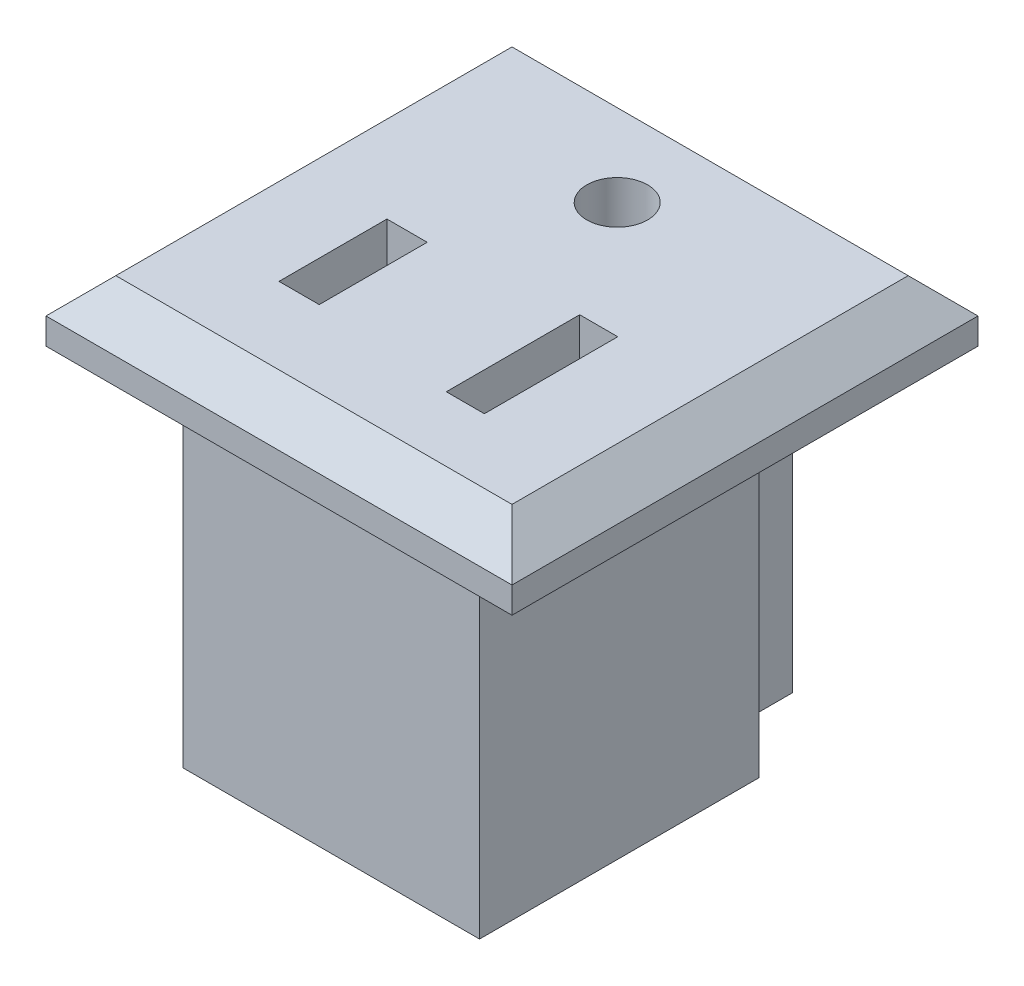
ISO-10303-21;
HEADER;
FILE_DESCRIPTION(('STEP AP214'),'2;1');
FILE_NAME('part.step','',(''),(''),'','','');
FILE_SCHEMA(('AUTOMOTIVE_DESIGN { 1 0 10303 214 1 1 1 1 }'));
ENDSEC;
DATA;
#1=APPLICATION_CONTEXT('core data for automotive mechanical design processes');
#2=APPLICATION_PROTOCOL_DEFINITION('international standard','automotive_design',2000,#1);
#3=PRODUCT_CONTEXT('',#1,'mechanical');
#4=PRODUCT('Part','Part','',(#3));
#5=PRODUCT_RELATED_PRODUCT_CATEGORY('part','',(#4));
#6=PRODUCT_DEFINITION_FORMATION('','',#4);
#7=PRODUCT_DEFINITION_CONTEXT('part definition',#1,'design');
#8=PRODUCT_DEFINITION('design','',#6,#7);
#9=PRODUCT_DEFINITION_SHAPE('','',#8);
#10=(LENGTH_UNIT() NAMED_UNIT(*) SI_UNIT(.MILLI.,.METRE.));
#11=(NAMED_UNIT(*) PLANE_ANGLE_UNIT() SI_UNIT($,.RADIAN.));
#12=(NAMED_UNIT(*) SI_UNIT($,.STERADIAN.) SOLID_ANGLE_UNIT());
#13=UNCERTAINTY_MEASURE_WITH_UNIT(LENGTH_MEASURE(1.E-05),#10,'distance_accuracy_value','');
#14=(GEOMETRIC_REPRESENTATION_CONTEXT(3) GLOBAL_UNCERTAINTY_ASSIGNED_CONTEXT((#13)) GLOBAL_UNIT_ASSIGNED_CONTEXT((#10,
#11,#12)) REPRESENTATION_CONTEXT('',''));
#15=CARTESIAN_POINT('',(0.,0.,0.));
#16=DIRECTION('',(0.,0.,1.));
#17=DIRECTION('',(1.,0.,0.));
#18=AXIS2_PLACEMENT_3D('',#15,#16,#17);
#19=CARTESIAN_POINT('',(0.,0.,0.));
#20=DIRECTION('',(0.,-1.,0.));
#21=DIRECTION('',(0.,0.,-1.));
#22=AXIS2_PLACEMENT_3D('',#19,#20,#21);
#23=PLANE('',#22);
#24=DIRECTION('',(0.,0.,1.));
#25=VECTOR('',#24,1.);
#26=CARTESIAN_POINT('',(-17.6814769975787,0.,0.));
#27=LINE('',#26,#25);
#28=CARTESIAN_POINT('',(-17.6814769975787,0.,-26.7));
#29=VERTEX_POINT('',#28);
#30=CARTESIAN_POINT('',(-17.6814769975787,0.,0.));
#31=VERTEX_POINT('',#30);
#32=EDGE_CURVE('E323',#29,#31,#27,.T.);
#33=ORIENTED_EDGE('',*,*,#32,.F.);
#34=DIRECTION('',(-1.,0.,0.));
#35=VECTOR('',#34,1.);
#36=CARTESIAN_POINT('',(-17.6814769975787,0.,-26.7));
#37=LINE('',#36,#35);
#38=CARTESIAN_POINT('',(9.01852300242131,0.,-26.7));
#39=VERTEX_POINT('',#38);
#40=EDGE_CURVE('E332',#39,#29,#37,.T.);
#41=ORIENTED_EDGE('',*,*,#40,.F.);
#42=DIRECTION('',(0.,0.,-1.));
#43=VECTOR('',#42,1.);
#44=CARTESIAN_POINT('',(9.01852300242131,0.,0.));
#45=LINE('',#44,#43);
#46=CARTESIAN_POINT('',(9.01852300242131,0.,0.));
#47=VERTEX_POINT('',#46);
#48=EDGE_CURVE('E329',#47,#39,#45,.T.);
#49=ORIENTED_EDGE('',*,*,#48,.F.);
#50=DIRECTION('',(1.,0.,0.));
#51=VECTOR('',#50,1.);
#52=CARTESIAN_POINT('',(-17.6814769975787,0.,0.));
#53=LINE('',#52,#51);
#54=EDGE_CURVE('E326',#31,#47,#53,.T.);
#55=ORIENTED_EDGE('',*,*,#54,.F.);
#56=EDGE_LOOP('',(#33,#41,#49,#55));
#57=FACE_BOUND('',#56,.T.);
#58=DIRECTION('',(1.,0.,0.));
#59=VECTOR('',#58,1.);
#60=CARTESIAN_POINT('',(-8.99745821000411,0.,-24.2));
#61=LINE('',#60,#59);
#62=CARTESIAN_POINT('',(-8.99745821000411,0.,-24.2));
#63=VERTEX_POINT('',#62);
#64=CARTESIAN_POINT('',(0.901796763469895,0.,-24.2));
#65=VERTEX_POINT('',#64);
#66=EDGE_CURVE('E274',#63,#65,#61,.T.);
#67=ORIENTED_EDGE('',*,*,#66,.F.);
#68=DIRECTION('',(0.,0.,-1.));
#69=VECTOR('',#68,1.);
#70=CARTESIAN_POINT('',(-8.99745821000411,0.,-19.));
#71=LINE('',#70,#69);
#72=CARTESIAN_POINT('',(-8.99745821000411,0.,-19.));
#73=VERTEX_POINT('',#72);
#74=EDGE_CURVE('E223',#73,#63,#71,.T.);
#75=ORIENTED_EDGE('',*,*,#74,.F.);
#76=DIRECTION('',(1.,0.,0.));
#77=VECTOR('',#76,1.);
#78=CARTESIAN_POINT('',(-12.8414769975787,0.,-19.));
#79=LINE('',#78,#77);
#80=CARTESIAN_POINT('',(-12.8414769975787,0.,-19.));
#81=VERTEX_POINT('',#80);
#82=EDGE_CURVE('E303',#81,#73,#79,.T.);
#83=ORIENTED_EDGE('',*,*,#82,.F.);
#84=DIRECTION('',(0.,0.,-1.));
#85=VECTOR('',#84,1.);
#86=CARTESIAN_POINT('',(-12.8414769975787,0.,-3.));
#87=LINE('',#86,#85);
#88=CARTESIAN_POINT('',(-12.8414769975787,0.,-3.));
#89=VERTEX_POINT('',#88);
#90=EDGE_CURVE('E286',#89,#81,#87,.T.);
#91=ORIENTED_EDGE('',*,*,#90,.F.);
#92=DIRECTION('',(-1.,0.,0.));
#93=VECTOR('',#92,1.);
#94=CARTESIAN_POINT('',(-12.8414769975787,0.,-3.));
#95=LINE('',#94,#93);
#96=CARTESIAN_POINT('',(4.15852300242131,0.,-3.));
#97=VERTEX_POINT('',#96);
#98=EDGE_CURVE('E291',#97,#89,#95,.T.);
#99=ORIENTED_EDGE('',*,*,#98,.F.);
#100=DIRECTION('',(0.,0.,1.));
#101=VECTOR('',#100,1.);
#102=CARTESIAN_POINT('',(4.15852300242131,0.,-3.));
#103=LINE('',#102,#101);
#104=CARTESIAN_POINT('',(4.15852300242131,0.,-19.));
#105=VERTEX_POINT('',#104);
#106=EDGE_CURVE('E306',#105,#97,#103,.T.);
#107=ORIENTED_EDGE('',*,*,#106,.F.);
#108=CARTESIAN_POINT('',(0.901796763469895,0.,-19.));
#109=VERTEX_POINT('',#108);
#110=EDGE_CURVE('E302',#109,#105,#79,.T.);
#111=ORIENTED_EDGE('',*,*,#110,.F.);
#112=DIRECTION('',(0.,0.,1.));
#113=VECTOR('',#112,1.);
#114=CARTESIAN_POINT('',(0.901796763469895,0.,-19.));
#115=LINE('',#114,#113);
#116=EDGE_CURVE('E266',#65,#109,#115,.T.);
#117=ORIENTED_EDGE('',*,*,#116,.F.);
#118=EDGE_LOOP('',(#67,#75,#83,#91,#99,#107,#111,#117));
#119=FACE_BOUND('',#118,.T.);
#120=ADVANCED_FACE('F37',(#57,#119),#23,.T.);
#121=CARTESIAN_POINT('',(-12.8414769975787,-20.,-19.));
#122=DIRECTION('',(0.,0.,1.));
#123=DIRECTION('',(1.,0.,0.));
#124=AXIS2_PLACEMENT_3D('',#121,#122,#123);
#125=PLANE('',#124);
#126=DIRECTION('',(0.,1.,0.));
#127=VECTOR('',#126,1.);
#128=CARTESIAN_POINT('',(-8.99745821000411,-20.,-19.));
#129=LINE('',#128,#127);
#130=CARTESIAN_POINT('',(-8.99745821000411,-20.,-19.));
#131=VERTEX_POINT('',#130);
#132=EDGE_CURVE('E271',#131,#73,#129,.T.);
#133=ORIENTED_EDGE('',*,*,#132,.F.);
#134=DIRECTION('',(1.,0.,0.));
#135=VECTOR('',#134,1.);
#136=CARTESIAN_POINT('',(-12.8414769975787,-20.,-19.));
#137=LINE('',#136,#135);
#138=CARTESIAN_POINT('',(-12.8414769975787,-20.,-19.));
#139=VERTEX_POINT('',#138);
#140=EDGE_CURVE('E292',#139,#131,#137,.T.);
#141=ORIENTED_EDGE('',*,*,#140,.F.);
#142=DIRECTION('',(0.,1.,0.));
#143=VECTOR('',#142,1.);
#144=CARTESIAN_POINT('',(-12.8414769975787,-20.,-19.));
#145=LINE('',#144,#143);
#146=EDGE_CURVE('E319',#139,#81,#145,.T.);
#147=ORIENTED_EDGE('',*,*,#146,.T.);
#148=ORIENTED_EDGE('',*,*,#82,.T.);
#149=EDGE_LOOP('',(#133,#141,#147,#148));
#150=FACE_BOUND('',#149,.T.);
#151=ADVANCED_FACE('F414',(#150),#125,.F.);
#152=DIRECTION('',(0.,1.,0.));
#153=VECTOR('',#152,1.);
#154=CARTESIAN_POINT('',(0.901796763469895,-20.,-19.));
#155=LINE('',#154,#153);
#156=CARTESIAN_POINT('',(0.901796763469895,-20.,-19.));
#157=VERTEX_POINT('',#156);
#158=EDGE_CURVE('E278',#157,#109,#155,.T.);
#159=ORIENTED_EDGE('',*,*,#158,.T.);
#160=ORIENTED_EDGE('',*,*,#110,.T.);
#161=DIRECTION('',(0.,1.,0.));
#162=VECTOR('',#161,1.);
#163=CARTESIAN_POINT('',(4.15852300242131,-20.,-19.));
#164=LINE('',#163,#162);
#165=CARTESIAN_POINT('',(4.15852300242131,-20.,-19.));
#166=VERTEX_POINT('',#165);
#167=EDGE_CURVE('E316',#166,#105,#164,.T.);
#168=ORIENTED_EDGE('',*,*,#167,.F.);
#169=EDGE_CURVE('E290',#157,#166,#137,.T.);
#170=ORIENTED_EDGE('',*,*,#169,.F.);
#171=EDGE_LOOP('',(#159,#160,#168,#170));
#172=FACE_BOUND('',#171,.T.);
#173=ADVANCED_FACE('F418',(#172),#125,.F.);
#174=CARTESIAN_POINT('',(-17.6814769975787,3.5,0.));
#175=DIRECTION('',(1.,0.,0.));
#176=DIRECTION('',(0.,0.,-1.));
#177=AXIS2_PLACEMENT_3D('',#174,#175,#176);
#178=PLANE('',#177);
#179=DIRECTION('',(0.,-1.,0.));
#180=VECTOR('',#179,1.);
#181=CARTESIAN_POINT('',(-17.6814769975787,3.5,0.));
#182=LINE('',#181,#180);
#183=CARTESIAN_POINT('',(-17.6814769975787,1.5,0.));
#184=VERTEX_POINT('',#183);
#185=EDGE_CURVE('E341',#184,#31,#182,.T.);
#186=ORIENTED_EDGE('',*,*,#185,.F.);
#187=DIRECTION('',(0.,0.,-1.));
#188=VECTOR('',#187,1.);
#189=CARTESIAN_POINT('',(-17.6814769975787,1.5,0.));
#190=LINE('',#189,#188);
#191=CARTESIAN_POINT('',(-17.6814769975787,1.5,-26.7));
#192=VERTEX_POINT('',#191);
#193=EDGE_CURVE('E11',#184,#192,#190,.T.);
#194=ORIENTED_EDGE('',*,*,#193,.T.);
#195=DIRECTION('',(0.,-1.,0.));
#196=VECTOR('',#195,1.);
#197=CARTESIAN_POINT('',(-17.6814769975787,3.5,-26.7));
#198=LINE('',#197,#196);
#199=EDGE_CURVE('E335',#192,#29,#198,.T.);
#200=ORIENTED_EDGE('',*,*,#199,.T.);
#201=ORIENTED_EDGE('',*,*,#32,.T.);
#202=EDGE_LOOP('',(#186,#194,#200,#201));
#203=FACE_BOUND('',#202,.T.);
#204=ADVANCED_FACE('F382',(#203),#178,.F.);
#205=CARTESIAN_POINT('',(-17.6814769975787,3.5,0.));
#206=DIRECTION('',(0.,0.,-1.));
#207=DIRECTION('',(-1.,0.,0.));
#208=AXIS2_PLACEMENT_3D('',#205,#206,#207);
#209=PLANE('',#208);
#210=DIRECTION('',(0.,-1.,0.));
#211=VECTOR('',#210,1.);
#212=CARTESIAN_POINT('',(9.01852300242131,3.5,0.));
#213=LINE('',#212,#211);
#214=CARTESIAN_POINT('',(9.01852300242131,1.5,0.));
#215=VERTEX_POINT('',#214);
#216=EDGE_CURVE('E339',#215,#47,#213,.T.);
#217=ORIENTED_EDGE('',*,*,#216,.F.);
#218=DIRECTION('',(-1.,0.,0.));
#219=VECTOR('',#218,1.);
#220=CARTESIAN_POINT('',(-17.6814769975787,1.5,0.));
#221=LINE('',#220,#219);
#222=EDGE_CURVE('E46',#215,#184,#221,.T.);
#223=ORIENTED_EDGE('',*,*,#222,.T.);
#224=ORIENTED_EDGE('',*,*,#185,.T.);
#225=ORIENTED_EDGE('',*,*,#54,.T.);
#226=EDGE_LOOP('',(#217,#223,#224,#225));
#227=FACE_BOUND('',#226,.T.);
#228=ADVANCED_FACE('F379',(#227),#209,.F.);
#229=CARTESIAN_POINT('',(9.01852300242131,3.5,0.));
#230=DIRECTION('',(-1.,0.,0.));
#231=DIRECTION('',(0.,0.,1.));
#232=AXIS2_PLACEMENT_3D('',#229,#230,#231);
#233=PLANE('',#232);
#234=DIRECTION('',(0.,-1.,0.));
#235=VECTOR('',#234,1.);
#236=CARTESIAN_POINT('',(9.01852300242131,3.5,-26.7));
#237=LINE('',#236,#235);
#238=CARTESIAN_POINT('',(9.01852300242131,1.5,-26.7));
#239=VERTEX_POINT('',#238);
#240=EDGE_CURVE('E337',#239,#39,#237,.T.);
#241=ORIENTED_EDGE('',*,*,#240,.F.);
#242=DIRECTION('',(0.,0.,1.));
#243=VECTOR('',#242,1.);
#244=CARTESIAN_POINT('',(9.01852300242131,1.5,0.));
#245=LINE('',#244,#243);
#246=EDGE_CURVE('E355',#239,#215,#245,.T.);
#247=ORIENTED_EDGE('',*,*,#246,.T.);
#248=ORIENTED_EDGE('',*,*,#216,.T.);
#249=ORIENTED_EDGE('',*,*,#48,.T.);
#250=EDGE_LOOP('',(#241,#247,#248,#249));
#251=FACE_BOUND('',#250,.T.);
#252=ADVANCED_FACE('F391',(#251),#233,.F.);
#253=CARTESIAN_POINT('',(-17.6814769975787,3.5,-26.7));
#254=DIRECTION('',(0.,0.,1.));
#255=DIRECTION('',(1.,0.,0.));
#256=AXIS2_PLACEMENT_3D('',#253,#254,#255);
#257=PLANE('',#256);
#258=ORIENTED_EDGE('',*,*,#199,.F.);
#259=DIRECTION('',(1.,0.,0.));
#260=VECTOR('',#259,1.);
#261=CARTESIAN_POINT('',(-17.6814769975787,1.5,-26.7));
#262=LINE('',#261,#260);
#263=EDGE_CURVE('E352',#192,#239,#262,.T.);
#264=ORIENTED_EDGE('',*,*,#263,.T.);
#265=ORIENTED_EDGE('',*,*,#240,.T.);
#266=ORIENTED_EDGE('',*,*,#40,.T.);
#267=EDGE_LOOP('',(#258,#264,#265,#266));
#268=FACE_BOUND('',#267,.T.);
#269=ADVANCED_FACE('F393',(#268),#257,.F.);
#270=CARTESIAN_POINT('',(0.,3.5,0.));
#271=DIRECTION('',(0.,-1.,0.));
#272=DIRECTION('',(0.,0.,-1.));
#273=AXIS2_PLACEMENT_3D('',#270,#271,#272);
#274=PLANE('',#273);
#275=DIRECTION('',(-1.,0.,0.));
#276=VECTOR('',#275,1.);
#277=CARTESIAN_POINT('',(1.72912999022401,3.5,-13.3489516467833));
#278=LINE('',#277,#276);
#279=CARTESIAN_POINT('',(1.72912999022401,3.5,-13.3489516467833));
#280=VERTEX_POINT('',#279);
#281=CARTESIAN_POINT('',(-0.452954499380098,3.5,-13.3489516467833));
#282=VERTEX_POINT('',#281);
#283=EDGE_CURVE('E216',#280,#282,#278,.T.);
#284=ORIENTED_EDGE('',*,*,#283,.F.);
#285=DIRECTION('',(0.,0.,-1.));
#286=VECTOR('',#285,1.);
#287=CARTESIAN_POINT('',(1.72912999022401,3.5,-5.70643503682255));
#288=LINE('',#287,#286);
#289=CARTESIAN_POINT('',(1.72912999022401,3.5,-5.70643503682255));
#290=VERTEX_POINT('',#289);
#291=EDGE_CURVE('E54',#290,#280,#288,.T.);
#292=ORIENTED_EDGE('',*,*,#291,.F.);
#293=DIRECTION('',(1.,0.,0.));
#294=VECTOR('',#293,1.);
#295=CARTESIAN_POINT('',(1.72912999022401,3.5,-5.70643503682255));
#296=LINE('',#295,#294);
#297=CARTESIAN_POINT('',(-0.452954499380098,3.5,-5.70643503682255));
#298=VERTEX_POINT('',#297);
#299=EDGE_CURVE('E207',#298,#290,#296,.T.);
#300=ORIENTED_EDGE('',*,*,#299,.F.);
#301=DIRECTION('',(0.,0.,1.));
#302=VECTOR('',#301,1.);
#303=CARTESIAN_POINT('',(-0.452954499380098,3.5,-5.70643503682255));
#304=LINE('',#303,#302);
#305=EDGE_CURVE('E210',#282,#298,#304,.T.);
#306=ORIENTED_EDGE('',*,*,#305,.F.);
#307=EDGE_LOOP('',(#284,#292,#300,#306));
#308=FACE_BOUND('',#307,.T.);
#309=DIRECTION('',(-1.,0.,0.));
#310=VECTOR('',#309,1.);
#311=CARTESIAN_POINT('',(-8.41734463057264,3.5,-12.5769760489831));
#312=LINE('',#311,#310);
#313=CARTESIAN_POINT('',(-8.41734463057264,3.5,-12.5769760489831));
#314=VERTEX_POINT('',#313);
#315=CARTESIAN_POINT('',(-10.7230924216708,3.5,-12.5769760489831));
#316=VERTEX_POINT('',#315);
#317=EDGE_CURVE('E242',#314,#316,#312,.T.);
#318=ORIENTED_EDGE('',*,*,#317,.F.);
#319=DIRECTION('',(0.,0.,-1.));
#320=VECTOR('',#319,1.);
#321=CARTESIAN_POINT('',(-8.41734463057264,3.5,-6.39033239276365));
#322=LINE('',#321,#320);
#323=CARTESIAN_POINT('',(-8.41734463057264,3.5,-6.39033239276365));
#324=VERTEX_POINT('',#323);
#325=EDGE_CURVE('E62',#324,#314,#322,.T.);
#326=ORIENTED_EDGE('',*,*,#325,.F.);
#327=DIRECTION('',(1.,0.,0.));
#328=VECTOR('',#327,1.);
#329=CARTESIAN_POINT('',(-8.41734463057264,3.5,-6.39033239276365));
#330=LINE('',#329,#328);
#331=CARTESIAN_POINT('',(-10.7230924216708,3.5,-6.39033239276365));
#332=VERTEX_POINT('',#331);
#333=EDGE_CURVE('E231',#332,#324,#330,.T.);
#334=ORIENTED_EDGE('',*,*,#333,.F.);
#335=DIRECTION('',(0.,0.,1.));
#336=VECTOR('',#335,1.);
#337=CARTESIAN_POINT('',(-10.7230924216708,3.5,-6.39033239276365));
#338=LINE('',#337,#336);
#339=EDGE_CURVE('E246',#316,#332,#338,.T.);
#340=ORIENTED_EDGE('',*,*,#339,.F.);
#341=EDGE_LOOP('',(#318,#326,#334,#340));
#342=FACE_BOUND('',#341,.T.);
#343=CARTESIAN_POINT('',(-4.95289307565372,3.5,-19.9990769135283));
#344=DIRECTION('',(0.,1.,0.));
#345=DIRECTION('',(0.,0.,1.));
#346=AXIS2_PLACEMENT_3D('',#343,#344,#345);
#347=CIRCLE('',#346,1.74387862614556);
#348=CARTESIAN_POINT('',(-4.95289307565372,3.5,-18.2551982873828));
#349=VERTEX_POINT('',#348);
#350=EDGE_CURVE('E259',#349,#349,#347,.T.);
#351=ORIENTED_EDGE('',*,*,#350,.F.);
#352=EDGE_LOOP('',(#351));
#353=FACE_BOUND('',#352,.T.);
#354=DIRECTION('',(0.,0.,-1.));
#355=VECTOR('',#354,1.);
#356=CARTESIAN_POINT('',(7.01852300242132,3.5,0.));
#357=LINE('',#356,#355);
#358=CARTESIAN_POINT('',(7.01852300242132,3.5,-1.99999999999999));
#359=VERTEX_POINT('',#358);
#360=CARTESIAN_POINT('',(7.01852300242132,3.5,-24.7));
#361=VERTEX_POINT('',#360);
#362=EDGE_CURVE('E347',#359,#361,#357,.T.);
#363=ORIENTED_EDGE('',*,*,#362,.T.);
#364=DIRECTION('',(-1.,0.,0.));
#365=VECTOR('',#364,1.);
#366=CARTESIAN_POINT('',(0.,3.5,-24.7));
#367=LINE('',#366,#365);
#368=CARTESIAN_POINT('',(-15.6814769975787,3.5,-24.7));
#369=VERTEX_POINT('',#368);
#370=EDGE_CURVE('E349',#361,#369,#367,.T.);
#371=ORIENTED_EDGE('',*,*,#370,.T.);
#372=DIRECTION('',(0.,0.,1.));
#373=VECTOR('',#372,1.);
#374=CARTESIAN_POINT('',(-15.6814769975787,3.5,0.));
#375=LINE('',#374,#373);
#376=CARTESIAN_POINT('',(-15.6814769975787,3.5,-1.99999999999999));
#377=VERTEX_POINT('',#376);
#378=EDGE_CURVE('E343',#369,#377,#375,.T.);
#379=ORIENTED_EDGE('',*,*,#378,.T.);
#380=DIRECTION('',(1.,0.,0.));
#381=VECTOR('',#380,1.);
#382=CARTESIAN_POINT('',(0.,3.5,-1.99999999999999));
#383=LINE('',#382,#381);
#384=EDGE_CURVE('E345',#377,#359,#383,.T.);
#385=ORIENTED_EDGE('',*,*,#384,.T.);
#386=EDGE_LOOP('',(#363,#371,#379,#385));
#387=FACE_BOUND('',#386,.T.);
#388=ADVANCED_FACE('F401',(#308,#342,#353,#387),#274,.F.);
#389=CARTESIAN_POINT('',(0.,3.5,-1.99999999999999));
#390=DIRECTION('',(0.,-0.707106781186546,-0.707106781186549));
#391=DIRECTION('',(1.,0.,0.));
#392=AXIS2_PLACEMENT_3D('',#389,#390,#391);
#393=PLANE('',#392);
#394=DIRECTION('',(0.577350269189625,0.577350269189628,-0.577350269189625));
#395=VECTOR('',#394,1.);
#396=CARTESIAN_POINT('',(-16.3481436642454,2.83333333333334,-1.33333333333333));
#397=LINE('',#396,#395);
#398=EDGE_CURVE('E360',#184,#377,#397,.T.);
#399=ORIENTED_EDGE('',*,*,#398,.F.);
#400=ORIENTED_EDGE('',*,*,#222,.F.);
#401=DIRECTION('',(-0.577350269189625,0.577350269189628,-0.577350269189625));
#402=VECTOR('',#401,1.);
#403=CARTESIAN_POINT('',(4.67901533494756,5.83950766747378,-4.33950766747375));
#404=LINE('',#403,#402);
#405=EDGE_CURVE('E41',#359,#215,#404,.F.);
#406=ORIENTED_EDGE('',*,*,#405,.F.);
#407=ORIENTED_EDGE('',*,*,#384,.F.);
#408=EDGE_LOOP('',(#399,#400,#406,#407));
#409=FACE_BOUND('',#408,.T.);
#410=ADVANCED_FACE('F39',(#409),#393,.F.);
#411=CARTESIAN_POINT('',(7.01852300242132,3.5,0.));
#412=DIRECTION('',(-0.70710678118655,-0.707106781186546,0.));
#413=DIRECTION('',(0.,0.,-1.));
#414=AXIS2_PLACEMENT_3D('',#411,#412,#413);
#415=PLANE('',#414);
#416=ORIENTED_EDGE('',*,*,#405,.T.);
#417=ORIENTED_EDGE('',*,*,#246,.F.);
#418=DIRECTION('',(-0.577350269189625,0.577350269189628,0.577350269189625));
#419=VECTOR('',#418,1.);
#420=CARTESIAN_POINT('',(-1.21481033091199,11.7333333333334,-16.4666666666667));
#421=LINE('',#420,#419);
#422=EDGE_CURVE('E359',#361,#239,#421,.F.);
#423=ORIENTED_EDGE('',*,*,#422,.F.);
#424=ORIENTED_EDGE('',*,*,#362,.F.);
#425=EDGE_LOOP('',(#416,#417,#423,#424));
#426=FACE_BOUND('',#425,.T.);
#427=ADVANCED_FACE('F371',(#426),#415,.F.);
#428=CARTESIAN_POINT('',(-15.6814769975787,3.5,0.));
#429=DIRECTION('',(0.707106781186549,-0.707106781186546,0.));
#430=DIRECTION('',(0.,0.,1.));
#431=AXIS2_PLACEMENT_3D('',#428,#429,#430);
#432=PLANE('',#431);
#433=ORIENTED_EDGE('',*,*,#398,.T.);
#434=ORIENTED_EDGE('',*,*,#378,.F.);
#435=DIRECTION('',(-0.577350269189625,-0.577350269189628,-0.577350269189625));
#436=VECTOR('',#435,1.);
#437=CARTESIAN_POINT('',(-7.4481436642454,11.7333333333334,-16.4666666666667));
#438=LINE('',#437,#436);
#439=EDGE_CURVE('E322',#192,#369,#438,.F.);
#440=ORIENTED_EDGE('',*,*,#439,.F.);
#441=ORIENTED_EDGE('',*,*,#193,.F.);
#442=EDGE_LOOP('',(#433,#434,#440,#441));
#443=FACE_BOUND('',#442,.T.);
#444=ADVANCED_FACE('F399',(#443),#432,.F.);
#445=CARTESIAN_POINT('',(0.,3.5,-24.7));
#446=DIRECTION('',(0.,-0.707106781186546,0.707106781186549));
#447=DIRECTION('',(-1.,0.,0.));
#448=AXIS2_PLACEMENT_3D('',#445,#446,#447);
#449=PLANE('',#448);
#450=ORIENTED_EDGE('',*,*,#422,.T.);
#451=ORIENTED_EDGE('',*,*,#263,.F.);
#452=ORIENTED_EDGE('',*,*,#439,.T.);
#453=ORIENTED_EDGE('',*,*,#370,.F.);
#454=EDGE_LOOP('',(#450,#451,#452,#453));
#455=FACE_BOUND('',#454,.T.);
#456=ADVANCED_FACE('F397',(#455),#449,.F.);
#457=CARTESIAN_POINT('',(-12.8414769975787,-20.,-3.));
#458=DIRECTION('',(1.,0.,0.));
#459=DIRECTION('',(0.,0.,-1.));
#460=AXIS2_PLACEMENT_3D('',#457,#458,#459);
#461=PLANE('',#460);
#462=ORIENTED_EDGE('',*,*,#90,.T.);
#463=ORIENTED_EDGE('',*,*,#146,.F.);
#464=DIRECTION('',(0.,0.,-1.));
#465=VECTOR('',#464,1.);
#466=CARTESIAN_POINT('',(-12.8414769975787,-20.,-3.));
#467=LINE('',#466,#465);
#468=CARTESIAN_POINT('',(-12.8414769975787,-20.,-3.));
#469=VERTEX_POINT('',#468);
#470=EDGE_CURVE('E287',#469,#139,#467,.T.);
#471=ORIENTED_EDGE('',*,*,#470,.F.);
#472=DIRECTION('',(0.,1.,0.));
#473=VECTOR('',#472,1.);
#474=CARTESIAN_POINT('',(-12.8414769975787,-20.,-3.));
#475=LINE('',#474,#473);
#476=EDGE_CURVE('E299',#469,#89,#475,.T.);
#477=ORIENTED_EDGE('',*,*,#476,.T.);
#478=EDGE_LOOP('',(#462,#463,#471,#477));
#479=FACE_BOUND('',#478,.T.);
#480=ADVANCED_FACE('F430',(#479),#461,.F.);
#481=CARTESIAN_POINT('',(4.15852300242131,-20.,-3.));
#482=DIRECTION('',(-1.,0.,0.));
#483=DIRECTION('',(0.,0.,1.));
#484=AXIS2_PLACEMENT_3D('',#481,#482,#483);
#485=PLANE('',#484);
#486=ORIENTED_EDGE('',*,*,#106,.T.);
#487=DIRECTION('',(0.,1.,0.));
#488=VECTOR('',#487,1.);
#489=CARTESIAN_POINT('',(4.15852300242131,-20.,-3.));
#490=LINE('',#489,#488);
#491=CARTESIAN_POINT('',(4.15852300242131,-20.,-3.));
#492=VERTEX_POINT('',#491);
#493=EDGE_CURVE('E313',#492,#97,#490,.T.);
#494=ORIENTED_EDGE('',*,*,#493,.F.);
#495=DIRECTION('',(0.,0.,1.));
#496=VECTOR('',#495,1.);
#497=CARTESIAN_POINT('',(4.15852300242131,-20.,-3.));
#498=LINE('',#497,#496);
#499=EDGE_CURVE('E295',#166,#492,#498,.T.);
#500=ORIENTED_EDGE('',*,*,#499,.F.);
#501=ORIENTED_EDGE('',*,*,#167,.T.);
#502=EDGE_LOOP('',(#486,#494,#500,#501));
#503=FACE_BOUND('',#502,.T.);
#504=ADVANCED_FACE('F451',(#503),#485,.F.);
#505=CARTESIAN_POINT('',(-12.8414769975787,-20.,-3.));
#506=DIRECTION('',(0.,0.,-1.));
#507=DIRECTION('',(-1.,0.,0.));
#508=AXIS2_PLACEMENT_3D('',#505,#506,#507);
#509=PLANE('',#508);
#510=ORIENTED_EDGE('',*,*,#98,.T.);
#511=ORIENTED_EDGE('',*,*,#476,.F.);
#512=DIRECTION('',(-1.,0.,0.));
#513=VECTOR('',#512,1.);
#514=CARTESIAN_POINT('',(-12.8414769975787,-20.,-3.));
#515=LINE('',#514,#513);
#516=EDGE_CURVE('E297',#492,#469,#515,.T.);
#517=ORIENTED_EDGE('',*,*,#516,.F.);
#518=ORIENTED_EDGE('',*,*,#493,.T.);
#519=EDGE_LOOP('',(#510,#511,#517,#518));
#520=FACE_BOUND('',#519,.T.);
#521=ADVANCED_FACE('F458',(#520),#509,.F.);
#522=CARTESIAN_POINT('',(0.,-20.,0.));
#523=DIRECTION('',(0.,-1.,0.));
#524=DIRECTION('',(0.,0.,-1.));
#525=AXIS2_PLACEMENT_3D('',#522,#523,#524);
#526=PLANE('',#525);
#527=ORIENTED_EDGE('',*,*,#470,.T.);
#528=ORIENTED_EDGE('',*,*,#140,.T.);
#529=DIRECTION('',(0.,0.,-1.));
#530=VECTOR('',#529,1.);
#531=CARTESIAN_POINT('',(-8.99745821000411,-20.,-19.));
#532=LINE('',#531,#530);
#533=CARTESIAN_POINT('',(-8.99745821000411,-20.,-24.2));
#534=VERTEX_POINT('',#533);
#535=EDGE_CURVE('E262',#131,#534,#532,.T.);
#536=ORIENTED_EDGE('',*,*,#535,.T.);
#537=DIRECTION('',(1.,0.,0.));
#538=VECTOR('',#537,1.);
#539=CARTESIAN_POINT('',(-8.99745821000411,-20.,-24.2));
#540=LINE('',#539,#538);
#541=CARTESIAN_POINT('',(0.901796763469895,-20.,-24.2));
#542=VERTEX_POINT('',#541);
#543=EDGE_CURVE('E265',#534,#542,#540,.T.);
#544=ORIENTED_EDGE('',*,*,#543,.T.);
#545=DIRECTION('',(0.,0.,1.));
#546=VECTOR('',#545,1.);
#547=CARTESIAN_POINT('',(0.901796763469895,-20.,-19.));
#548=LINE('',#547,#546);
#549=EDGE_CURVE('E268',#542,#157,#548,.T.);
#550=ORIENTED_EDGE('',*,*,#549,.T.);
#551=ORIENTED_EDGE('',*,*,#169,.T.);
#552=ORIENTED_EDGE('',*,*,#499,.T.);
#553=ORIENTED_EDGE('',*,*,#516,.T.);
#554=EDGE_LOOP('',(#527,#528,#536,#544,#550,#551,#552,#553));
#555=FACE_BOUND('',#554,.T.);
#556=ADVANCED_FACE('F466',(#555),#526,.T.);
#557=CARTESIAN_POINT('',(-8.99745821000411,-20.,-19.));
#558=DIRECTION('',(1.,0.,0.));
#559=DIRECTION('',(0.,0.,-1.));
#560=AXIS2_PLACEMENT_3D('',#557,#558,#559);
#561=PLANE('',#560);
#562=ORIENTED_EDGE('',*,*,#74,.T.);
#563=DIRECTION('',(0.,1.,0.));
#564=VECTOR('',#563,1.);
#565=CARTESIAN_POINT('',(-8.99745821000411,-20.,-24.2));
#566=LINE('',#565,#564);
#567=EDGE_CURVE('E284',#534,#63,#566,.T.);
#568=ORIENTED_EDGE('',*,*,#567,.F.);
#569=ORIENTED_EDGE('',*,*,#535,.F.);
#570=ORIENTED_EDGE('',*,*,#132,.T.);
#571=EDGE_LOOP('',(#562,#568,#569,#570));
#572=FACE_BOUND('',#571,.T.);
#573=ADVANCED_FACE('F474',(#572),#561,.F.);
#574=CARTESIAN_POINT('',(-8.99745821000411,-20.,-24.2));
#575=DIRECTION('',(0.,0.,1.));
#576=DIRECTION('',(1.,0.,0.));
#577=AXIS2_PLACEMENT_3D('',#574,#575,#576);
#578=PLANE('',#577);
#579=ORIENTED_EDGE('',*,*,#66,.T.);
#580=DIRECTION('',(0.,1.,0.));
#581=VECTOR('',#580,1.);
#582=CARTESIAN_POINT('',(0.901796763469895,-20.,-24.2));
#583=LINE('',#582,#581);
#584=EDGE_CURVE('E281',#542,#65,#583,.T.);
#585=ORIENTED_EDGE('',*,*,#584,.F.);
#586=ORIENTED_EDGE('',*,*,#543,.F.);
#587=ORIENTED_EDGE('',*,*,#567,.T.);
#588=EDGE_LOOP('',(#579,#585,#586,#587));
#589=FACE_BOUND('',#588,.T.);
#590=ADVANCED_FACE('F483',(#589),#578,.F.);
#591=CARTESIAN_POINT('',(0.901796763469895,-20.,-19.));
#592=DIRECTION('',(-1.,0.,0.));
#593=DIRECTION('',(0.,0.,1.));
#594=AXIS2_PLACEMENT_3D('',#591,#592,#593);
#595=PLANE('',#594);
#596=ORIENTED_EDGE('',*,*,#116,.T.);
#597=ORIENTED_EDGE('',*,*,#158,.F.);
#598=ORIENTED_EDGE('',*,*,#549,.F.);
#599=ORIENTED_EDGE('',*,*,#584,.T.);
#600=EDGE_LOOP('',(#596,#597,#598,#599));
#601=FACE_BOUND('',#600,.T.);
#602=ADVANCED_FACE('F491',(#601),#595,.F.);
#603=CARTESIAN_POINT('',(-4.95289307565372,-1.5,-19.9990769135283));
#604=DIRECTION('',(0.,1.,0.));
#605=DIRECTION('',(0.,0.,1.));
#606=AXIS2_PLACEMENT_3D('',#603,#604,#605);
#607=CYLINDRICAL_SURFACE('',#606,1.74387862614556);
#608=CARTESIAN_POINT('',(-4.95289307565372,-1.5,-19.9990769135283));
#609=DIRECTION('',(0.,1.,0.));
#610=DIRECTION('',(0.,0.,1.));
#611=AXIS2_PLACEMENT_3D('',#608,#609,#610);
#612=CIRCLE('',#611,1.74387862614556);
#613=CARTESIAN_POINT('',(-4.95289307565372,-1.5,-18.2551982873828));
#614=VERTEX_POINT('',#613);
#615=EDGE_CURVE('E243',#614,#614,#612,.T.);
#616=ORIENTED_EDGE('',*,*,#615,.F.);
#617=EDGE_LOOP('',(#616));
#618=FACE_BOUND('',#617,.T.);
#619=ORIENTED_EDGE('',*,*,#350,.T.);
#620=EDGE_LOOP('',(#619));
#621=FACE_BOUND('',#620,.T.);
#622=ADVANCED_FACE('F499',(#618,#621),#607,.F.);
#623=CARTESIAN_POINT('',(-4.95289307565372,-1.5,-19.9990769135283));
#624=DIRECTION('',(0.,1.,0.));
#625=DIRECTION('',(0.,0.,1.));
#626=AXIS2_PLACEMENT_3D('',#623,#624,#625);
#627=PLANE('',#626);
#628=ORIENTED_EDGE('',*,*,#615,.T.);
#629=EDGE_LOOP('',(#628));
#630=FACE_BOUND('',#629,.T.);
#631=ADVANCED_FACE('F507',(#630),#627,.T.);
#632=CARTESIAN_POINT('',(-8.41734463057264,-1.5,-6.39033239276365));
#633=DIRECTION('',(1.,0.,0.));
#634=DIRECTION('',(0.,0.,-1.));
#635=AXIS2_PLACEMENT_3D('',#632,#633,#634);
#636=PLANE('',#635);
#637=ORIENTED_EDGE('',*,*,#325,.T.);
#638=DIRECTION('',(0.,1.,0.));
#639=VECTOR('',#638,1.);
#640=CARTESIAN_POINT('',(-8.41734463057264,-1.5,-12.5769760489831));
#641=LINE('',#640,#639);
#642=CARTESIAN_POINT('',(-8.41734463057264,-1.5,-12.5769760489831));
#643=VERTEX_POINT('',#642);
#644=EDGE_CURVE('E240',#643,#314,#641,.T.);
#645=ORIENTED_EDGE('',*,*,#644,.F.);
#646=DIRECTION('',(0.,0.,-1.));
#647=VECTOR('',#646,1.);
#648=CARTESIAN_POINT('',(-8.41734463057264,-1.5,-6.39033239276365));
#649=LINE('',#648,#647);
#650=CARTESIAN_POINT('',(-8.41734463057264,-1.5,-6.39033239276365));
#651=VERTEX_POINT('',#650);
#652=EDGE_CURVE('E227',#651,#643,#649,.T.);
#653=ORIENTED_EDGE('',*,*,#652,.F.);
#654=DIRECTION('',(0.,1.,0.));
#655=VECTOR('',#654,1.);
#656=CARTESIAN_POINT('',(-8.41734463057264,-1.5,-6.39033239276365));
#657=LINE('',#656,#655);
#658=EDGE_CURVE('E217',#651,#324,#657,.T.);
#659=ORIENTED_EDGE('',*,*,#658,.T.);
#660=EDGE_LOOP('',(#637,#645,#653,#659));
#661=FACE_BOUND('',#660,.T.);
#662=ADVANCED_FACE('F515',(#661),#636,.F.);
#663=CARTESIAN_POINT('',(-8.41734463057264,-1.5,-6.39033239276365));
#664=DIRECTION('',(0.,0.,1.));
#665=DIRECTION('',(1.,0.,0.));
#666=AXIS2_PLACEMENT_3D('',#663,#664,#665);
#667=PLANE('',#666);
#668=ORIENTED_EDGE('',*,*,#333,.T.);
#669=ORIENTED_EDGE('',*,*,#658,.F.);
#670=DIRECTION('',(1.,0.,0.));
#671=VECTOR('',#670,1.);
#672=CARTESIAN_POINT('',(-8.41734463057264,-1.5,-6.39033239276365));
#673=LINE('',#672,#671);
#674=CARTESIAN_POINT('',(-10.7230924216708,-1.5,-6.39033239276365));
#675=VERTEX_POINT('',#674);
#676=EDGE_CURVE('E237',#675,#651,#673,.T.);
#677=ORIENTED_EDGE('',*,*,#676,.F.);
#678=DIRECTION('',(0.,1.,0.));
#679=VECTOR('',#678,1.);
#680=CARTESIAN_POINT('',(-10.7230924216708,-1.5,-6.39033239276365));
#681=LINE('',#680,#679);
#682=EDGE_CURVE('E252',#675,#332,#681,.T.);
#683=ORIENTED_EDGE('',*,*,#682,.T.);
#684=EDGE_LOOP('',(#668,#669,#677,#683));
#685=FACE_BOUND('',#684,.T.);
#686=ADVANCED_FACE('F523',(#685),#667,.F.);
#687=CARTESIAN_POINT('',(-10.7230924216708,-1.5,-6.39033239276365));
#688=DIRECTION('',(-1.,0.,0.));
#689=DIRECTION('',(0.,0.,1.));
#690=AXIS2_PLACEMENT_3D('',#687,#688,#689);
#691=PLANE('',#690);
#692=ORIENTED_EDGE('',*,*,#339,.T.);
#693=ORIENTED_EDGE('',*,*,#682,.F.);
#694=DIRECTION('',(0.,0.,1.));
#695=VECTOR('',#694,1.);
#696=CARTESIAN_POINT('',(-10.7230924216708,-1.5,-6.39033239276365));
#697=LINE('',#696,#695);
#698=CARTESIAN_POINT('',(-10.7230924216708,-1.5,-12.5769760489831));
#699=VERTEX_POINT('',#698);
#700=EDGE_CURVE('E234',#699,#675,#697,.T.);
#701=ORIENTED_EDGE('',*,*,#700,.F.);
#702=DIRECTION('',(0.,1.,0.));
#703=VECTOR('',#702,1.);
#704=CARTESIAN_POINT('',(-10.7230924216708,-1.5,-12.5769760489831));
#705=LINE('',#704,#703);
#706=EDGE_CURVE('E254',#699,#316,#705,.T.);
#707=ORIENTED_EDGE('',*,*,#706,.T.);
#708=EDGE_LOOP('',(#692,#693,#701,#707));
#709=FACE_BOUND('',#708,.T.);
#710=ADVANCED_FACE('F530',(#709),#691,.F.);
#711=CARTESIAN_POINT('',(-8.41734463057264,-1.5,-12.5769760489831));
#712=DIRECTION('',(0.,0.,-1.));
#713=DIRECTION('',(-1.,0.,0.));
#714=AXIS2_PLACEMENT_3D('',#711,#712,#713);
#715=PLANE('',#714);
#716=ORIENTED_EDGE('',*,*,#317,.T.);
#717=ORIENTED_EDGE('',*,*,#706,.F.);
#718=DIRECTION('',(-1.,0.,0.));
#719=VECTOR('',#718,1.);
#720=CARTESIAN_POINT('',(-8.41734463057264,-1.5,-12.5769760489831));
#721=LINE('',#720,#719);
#722=EDGE_CURVE('E230',#643,#699,#721,.T.);
#723=ORIENTED_EDGE('',*,*,#722,.F.);
#724=ORIENTED_EDGE('',*,*,#644,.T.);
#725=EDGE_LOOP('',(#716,#717,#723,#724));
#726=FACE_BOUND('',#725,.T.);
#727=ADVANCED_FACE('F538',(#726),#715,.F.);
#728=CARTESIAN_POINT('',(0.,-1.5,0.));
#729=DIRECTION('',(0.,1.,0.));
#730=DIRECTION('',(0.,0.,1.));
#731=AXIS2_PLACEMENT_3D('',#728,#729,#730);
#732=PLANE('',#731);
#733=ORIENTED_EDGE('',*,*,#652,.T.);
#734=ORIENTED_EDGE('',*,*,#722,.T.);
#735=ORIENTED_EDGE('',*,*,#700,.T.);
#736=ORIENTED_EDGE('',*,*,#676,.T.);
#737=EDGE_LOOP('',(#733,#734,#735,#736));
#738=FACE_BOUND('',#737,.T.);
#739=ADVANCED_FACE('F546',(#738),#732,.T.);
#740=CARTESIAN_POINT('',(1.72912999022401,-1.5,-5.70643503682255));
#741=DIRECTION('',(1.,0.,0.));
#742=DIRECTION('',(0.,0.,-1.));
#743=AXIS2_PLACEMENT_3D('',#740,#741,#742);
#744=PLANE('',#743);
#745=ORIENTED_EDGE('',*,*,#291,.T.);
#746=DIRECTION('',(0.,1.,0.));
#747=VECTOR('',#746,1.);
#748=CARTESIAN_POINT('',(1.72912999022401,-1.5,-13.3489516467833));
#749=LINE('',#748,#747);
#750=CARTESIAN_POINT('',(1.72912999022401,-1.5,-13.3489516467833));
#751=VERTEX_POINT('',#750);
#752=EDGE_CURVE('E185',#751,#280,#749,.T.);
#753=ORIENTED_EDGE('',*,*,#752,.F.);
#754=DIRECTION('',(0.,0.,-1.));
#755=VECTOR('',#754,1.);
#756=CARTESIAN_POINT('',(1.72912999022401,-1.5,-5.70643503682255));
#757=LINE('',#756,#755);
#758=CARTESIAN_POINT('',(1.72912999022401,-1.5,-5.70643503682255));
#759=VERTEX_POINT('',#758);
#760=EDGE_CURVE('E189',#759,#751,#757,.T.);
#761=ORIENTED_EDGE('',*,*,#760,.F.);
#762=DIRECTION('',(0.,1.,0.));
#763=VECTOR('',#762,1.);
#764=CARTESIAN_POINT('',(1.72912999022401,-1.5,-5.70643503682255));
#765=LINE('',#764,#763);
#766=EDGE_CURVE('E221',#759,#290,#765,.T.);
#767=ORIENTED_EDGE('',*,*,#766,.T.);
#768=EDGE_LOOP('',(#745,#753,#761,#767));
#769=FACE_BOUND('',#768,.T.);
#770=ADVANCED_FACE('F187',(#769),#744,.F.);
#771=CARTESIAN_POINT('',(1.72912999022401,-1.5,-5.70643503682255));
#772=DIRECTION('',(0.,0.,1.));
#773=DIRECTION('',(1.,0.,0.));
#774=AXIS2_PLACEMENT_3D('',#771,#772,#773);
#775=PLANE('',#774);
#776=ORIENTED_EDGE('',*,*,#299,.T.);
#777=ORIENTED_EDGE('',*,*,#766,.F.);
#778=DIRECTION('',(1.,0.,0.));
#779=VECTOR('',#778,1.);
#780=CARTESIAN_POINT('',(1.72912999022401,-1.5,-5.70643503682255));
#781=LINE('',#780,#779);
#782=CARTESIAN_POINT('',(-0.452954499380098,-1.5,-5.70643503682255));
#783=VERTEX_POINT('',#782);
#784=EDGE_CURVE('E195',#783,#759,#781,.T.);
#785=ORIENTED_EDGE('',*,*,#784,.F.);
#786=DIRECTION('',(0.,1.,0.));
#787=VECTOR('',#786,1.);
#788=CARTESIAN_POINT('',(-0.452954499380098,-1.5,-5.70643503682255));
#789=LINE('',#788,#787);
#790=EDGE_CURVE('E224',#783,#298,#789,.T.);
#791=ORIENTED_EDGE('',*,*,#790,.T.);
#792=EDGE_LOOP('',(#776,#777,#785,#791));
#793=FACE_BOUND('',#792,.T.);
#794=ADVANCED_FACE('F561',(#793),#775,.F.);
#795=CARTESIAN_POINT('',(-0.452954499380098,-1.5,-5.70643503682255));
#796=DIRECTION('',(-1.,0.,0.));
#797=DIRECTION('',(0.,0.,1.));
#798=AXIS2_PLACEMENT_3D('',#795,#796,#797);
#799=PLANE('',#798);
#800=ORIENTED_EDGE('',*,*,#305,.T.);
#801=ORIENTED_EDGE('',*,*,#790,.F.);
#802=DIRECTION('',(0.,0.,1.));
#803=VECTOR('',#802,1.);
#804=CARTESIAN_POINT('',(-0.452954499380098,-1.5,-5.70643503682255));
#805=LINE('',#804,#803);
#806=CARTESIAN_POINT('',(-0.452954499380098,-1.5,-13.3489516467833));
#807=VERTEX_POINT('',#806);
#808=EDGE_CURVE('E203',#807,#783,#805,.T.);
#809=ORIENTED_EDGE('',*,*,#808,.F.);
#810=DIRECTION('',(0.,1.,0.));
#811=VECTOR('',#810,1.);
#812=CARTESIAN_POINT('',(-0.452954499380098,-1.5,-13.3489516467833));
#813=LINE('',#812,#811);
#814=EDGE_CURVE('E194',#807,#282,#813,.T.);
#815=ORIENTED_EDGE('',*,*,#814,.T.);
#816=EDGE_LOOP('',(#800,#801,#809,#815));
#817=FACE_BOUND('',#816,.T.);
#818=ADVANCED_FACE('F568',(#817),#799,.F.);
#819=CARTESIAN_POINT('',(1.72912999022401,-1.5,-13.3489516467833));
#820=DIRECTION('',(0.,0.,-1.));
#821=DIRECTION('',(-1.,0.,0.));
#822=AXIS2_PLACEMENT_3D('',#819,#820,#821);
#823=PLANE('',#822);
#824=ORIENTED_EDGE('',*,*,#283,.T.);
#825=ORIENTED_EDGE('',*,*,#814,.F.);
#826=DIRECTION('',(-1.,0.,0.));
#827=VECTOR('',#826,1.);
#828=CARTESIAN_POINT('',(1.72912999022401,-1.5,-13.3489516467833));
#829=LINE('',#828,#827);
#830=EDGE_CURVE('E198',#751,#807,#829,.T.);
#831=ORIENTED_EDGE('',*,*,#830,.F.);
#832=ORIENTED_EDGE('',*,*,#752,.T.);
#833=EDGE_LOOP('',(#824,#825,#831,#832));
#834=FACE_BOUND('',#833,.T.);
#835=ADVANCED_FACE('F199',(#834),#823,.F.);
#836=CARTESIAN_POINT('',(0.,-1.5,0.));
#837=DIRECTION('',(0.,1.,0.));
#838=DIRECTION('',(0.,0.,1.));
#839=AXIS2_PLACEMENT_3D('',#836,#837,#838);
#840=PLANE('',#839);
#841=ORIENTED_EDGE('',*,*,#760,.T.);
#842=ORIENTED_EDGE('',*,*,#830,.T.);
#843=ORIENTED_EDGE('',*,*,#808,.T.);
#844=ORIENTED_EDGE('',*,*,#784,.T.);
#845=EDGE_LOOP('',(#841,#842,#843,#844));
#846=FACE_BOUND('',#845,.T.);
#847=ADVANCED_FACE('F205',(#846),#840,.T.);
#848=CLOSED_SHELL('',(#120,#151,#173,#204,#228,#252,#269,#388,#410,#427,#444,#456,#480,#504,
#521,#556,#573,#590,#602,#622,#631,#662,#686,#710,#727,#739,#770,#794,#818,#835,#847));
#849=MANIFOLD_SOLID_BREP('B2',#848);
#850=ADVANCED_BREP_SHAPE_REPRESENTATION('',(#18,#849),#14);
#851=SHAPE_DEFINITION_REPRESENTATION(#9,#850);
ENDSEC;
END-ISO-10303-21;
